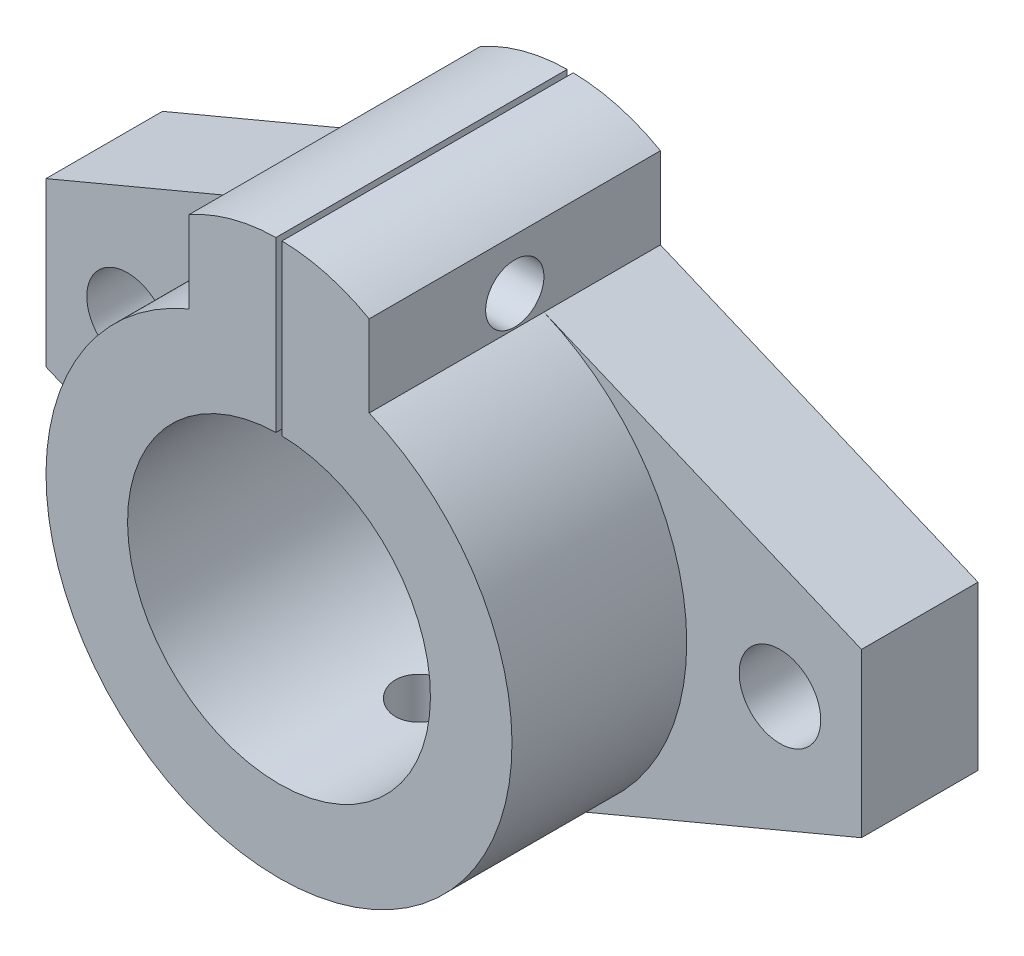
ISO-10303-21;
HEADER;
FILE_DESCRIPTION(('STEP AP214'),'2;1');
FILE_NAME('part.step','',(''),(''),'','','');
FILE_SCHEMA(('AUTOMOTIVE_DESIGN { 1 0 10303 214 1 1 1 1 }'));
ENDSEC;
DATA;
#1=APPLICATION_CONTEXT('core data for automotive mechanical design processes');
#2=APPLICATION_PROTOCOL_DEFINITION('international standard','automotive_design',2000,#1);
#3=PRODUCT_CONTEXT('',#1,'mechanical');
#4=PRODUCT('Part','Part','',(#3));
#5=PRODUCT_RELATED_PRODUCT_CATEGORY('part','',(#4));
#6=PRODUCT_DEFINITION_FORMATION('','',#4);
#7=PRODUCT_DEFINITION_CONTEXT('part definition',#1,'design');
#8=PRODUCT_DEFINITION('design','',#6,#7);
#9=PRODUCT_DEFINITION_SHAPE('','',#8);
#10=(LENGTH_UNIT() NAMED_UNIT(*) SI_UNIT(.MILLI.,.METRE.));
#11=(NAMED_UNIT(*) PLANE_ANGLE_UNIT() SI_UNIT($,.RADIAN.));
#12=(NAMED_UNIT(*) SI_UNIT($,.STERADIAN.) SOLID_ANGLE_UNIT());
#13=UNCERTAINTY_MEASURE_WITH_UNIT(LENGTH_MEASURE(1.E-05),#10,'distance_accuracy_value','');
#14=(GEOMETRIC_REPRESENTATION_CONTEXT(3) GLOBAL_UNCERTAINTY_ASSIGNED_CONTEXT((#13)) GLOBAL_UNIT_ASSIGNED_CONTEXT((#10,
#11,#12)) REPRESENTATION_CONTEXT('',''));
#15=CARTESIAN_POINT('',(0.,0.,0.));
#16=DIRECTION('',(0.,0.,1.));
#17=DIRECTION('',(1.,0.,0.));
#18=AXIS2_PLACEMENT_3D('',#15,#16,#17);
#19=CARTESIAN_POINT('',(0.,11.87489743787,10.));
#20=DIRECTION('',(0.,0.,-1.));
#21=DIRECTION('',(-1.,0.,0.));
#22=AXIS2_PLACEMENT_3D('',#19,#20,#21);
#23=CYLINDRICAL_SURFACE('',#22,15.6193467136848);
#24=DIRECTION('',(0.,0.,-1.));
#25=VECTOR('',#24,1.);
#26=CARTESIAN_POINT('',(-0.258597553957538,27.4921033040735,10.));
#27=LINE('',#26,#25);
#28=CARTESIAN_POINT('',(-0.258597553957538,27.4921033040735,0.));
#29=VERTEX_POINT('',#28);
#30=CARTESIAN_POINT('',(-0.258597553957538,27.4921033040735,25.));
#31=VERTEX_POINT('',#30);
#32=EDGE_CURVE('E64',#29,#31,#27,.F.);
#33=ORIENTED_EDGE('',*,*,#32,.F.);
#34=CARTESIAN_POINT('',(0.,11.87489743787,0.));
#35=DIRECTION('',(0.,0.,1.));
#36=DIRECTION('',(1.,0.,0.));
#37=AXIS2_PLACEMENT_3D('',#34,#35,#36);
#38=CIRCLE('',#37,15.6193467136848);
#39=CARTESIAN_POINT('',(-7.74027571439312,25.441478570472,0.));
#40=VERTEX_POINT('',#39);
#41=EDGE_CURVE('E304',#40,#29,#38,.F.);
#42=ORIENTED_EDGE('',*,*,#41,.F.);
#43=DIRECTION('',(0.,0.,-1.));
#44=VECTOR('',#43,1.);
#45=CARTESIAN_POINT('',(-7.74027571439312,25.441478570472,10.));
#46=LINE('',#45,#44);
#47=CARTESIAN_POINT('',(-7.74027571439312,25.441478570472,25.));
#48=VERTEX_POINT('',#47);
#49=EDGE_CURVE('E264',#48,#40,#46,.T.);
#50=ORIENTED_EDGE('',*,*,#49,.F.);
#51=CARTESIAN_POINT('',(0.,11.8748974378699,25.));
#52=DIRECTION('',(0.,0.,1.));
#53=DIRECTION('',(-1.,0.,0.));
#54=AXIS2_PLACEMENT_3D('',#51,#52,#53);
#55=CIRCLE('',#54,15.6193467136848);
#56=EDGE_CURVE('E169',#31,#48,#55,.T.);
#57=ORIENTED_EDGE('',*,*,#56,.F.);
#58=EDGE_LOOP('',(#33,#42,#50,#57));
#59=FACE_BOUND('',#58,.T.);
#60=ADVANCED_FACE('F36',(#59),#23,.T.);
#61=CARTESIAN_POINT('',(0.,0.,10.));
#62=DIRECTION('',(0.,0.,1.));
#63=DIRECTION('',(1.,0.,0.));
#64=AXIS2_PLACEMENT_3D('',#61,#62,#63);
#65=PLANE('',#64);
#66=CARTESIAN_POINT('',(0.,0.,10.));
#67=DIRECTION('',(0.,0.,1.));
#68=DIRECTION('',(1.,0.,0.));
#69=AXIS2_PLACEMENT_3D('',#66,#67,#68);
#70=CIRCLE('',#69,20.);
#71=CARTESIAN_POINT('',(-7.74027571439312,18.441478570472,10.));
#72=VERTEX_POINT('',#71);
#73=CARTESIAN_POINT('',(-7.74027571439311,-18.441478570472,10.));
#74=VERTEX_POINT('',#73);
#75=EDGE_CURVE('E182',#72,#74,#70,.T.);
#76=ORIENTED_EDGE('',*,*,#75,.F.);
#77=DIRECTION('',(0.922073928523597,0.387013785719656,0.));
#78=VECTOR('',#77,1.);
#79=CARTESIAN_POINT('',(-7.74027571439313,18.441478570472,10.));
#80=LINE('',#79,#78);
#81=CARTESIAN_POINT('',(-35.0000000000568,7.00000000013542,10.));
#82=VERTEX_POINT('',#81);
#83=EDGE_CURVE('E316',#82,#72,#80,.T.);
#84=ORIENTED_EDGE('',*,*,#83,.F.);
#85=DIRECTION('',(0.,1.,0.));
#86=VECTOR('',#85,1.);
#87=CARTESIAN_POINT('',(-35.0000000000568,0.,10.));
#88=LINE('',#87,#86);
#89=CARTESIAN_POINT('',(-35.0000000000568,-7.00000000013543,10.));
#90=VERTEX_POINT('',#89);
#91=EDGE_CURVE('E212',#90,#82,#88,.T.);
#92=ORIENTED_EDGE('',*,*,#91,.F.);
#93=DIRECTION('',(0.922073928523598,-0.387013785719656,0.));
#94=VECTOR('',#93,1.);
#95=CARTESIAN_POINT('',(-7.74027571439311,-18.441478570472,10.));
#96=LINE('',#95,#94);
#97=EDGE_CURVE('E208',#90,#74,#96,.T.);
#98=ORIENTED_EDGE('',*,*,#97,.T.);
#99=EDGE_LOOP('',(#76,#84,#92,#98));
#100=FACE_BOUND('',#99,.T.);
#101=CARTESIAN_POINT('',(-28.,0.,10.));
#102=DIRECTION('',(0.,0.,1.));
#103=DIRECTION('',(1.,0.,0.));
#104=AXIS2_PLACEMENT_3D('',#101,#102,#103);
#105=CIRCLE('',#104,3.5);
#106=CARTESIAN_POINT('',(-24.5,0.,10.));
#107=VERTEX_POINT('',#106);
#108=EDGE_CURVE('E276',#107,#107,#105,.T.);
#109=ORIENTED_EDGE('',*,*,#108,.F.);
#110=EDGE_LOOP('',(#109));
#111=FACE_BOUND('',#110,.T.);
#112=ADVANCED_FACE('F350',(#100,#111),#65,.T.);
#113=CARTESIAN_POINT('',(7.74027571439313,18.441478570472,10.));
#114=DIRECTION('',(-0.387013785719656,-0.922073928523597,0.));
#115=DIRECTION('',(0.922073928523597,-0.387013785719656,0.));
#116=AXIS2_PLACEMENT_3D('',#113,#114,#115);
#117=PLANE('',#116);
#118=DIRECTION('',(-0.922073928523597,0.387013785719656,0.));
#119=VECTOR('',#118,1.);
#120=CARTESIAN_POINT('',(7.74027571439313,18.441478570472,0.));
#121=LINE('',#120,#119);
#122=CARTESIAN_POINT('',(35.0000000000568,7.00000000013542,0.));
#123=VERTEX_POINT('',#122);
#124=CARTESIAN_POINT('',(7.74027571439312,18.441478570472,0.));
#125=VERTEX_POINT('',#124);
#126=EDGE_CURVE('E181',#123,#125,#121,.T.);
#127=ORIENTED_EDGE('',*,*,#126,.T.);
#128=DIRECTION('',(0.,0.,-1.));
#129=VECTOR('',#128,1.);
#130=CARTESIAN_POINT('',(7.74027571439312,18.441478570472,10.));
#131=LINE('',#130,#129);
#132=CARTESIAN_POINT('',(7.74027571439312,18.441478570472,10.));
#133=VERTEX_POINT('',#132);
#134=EDGE_CURVE('E193',#133,#125,#131,.T.);
#135=ORIENTED_EDGE('',*,*,#134,.F.);
#136=DIRECTION('',(-0.922073928523597,0.387013785719656,0.));
#137=VECTOR('',#136,1.);
#138=CARTESIAN_POINT('',(7.74027571439313,18.441478570472,10.));
#139=LINE('',#138,#137);
#140=CARTESIAN_POINT('',(35.0000000000568,7.00000000013542,10.));
#141=VERTEX_POINT('',#140);
#142=EDGE_CURVE('E188',#141,#133,#139,.T.);
#143=ORIENTED_EDGE('',*,*,#142,.F.);
#144=DIRECTION('',(0.,0.,-1.));
#145=VECTOR('',#144,1.);
#146=CARTESIAN_POINT('',(35.0000000000568,7.00000000013542,10.));
#147=LINE('',#146,#145);
#148=EDGE_CURVE('E273',#141,#123,#147,.T.);
#149=ORIENTED_EDGE('',*,*,#148,.T.);
#150=EDGE_LOOP('',(#127,#135,#143,#149));
#151=FACE_BOUND('',#150,.T.);
#152=ADVANCED_FACE('F38',(#151),#117,.F.);
#153=CARTESIAN_POINT('',(7.74027571439312,0.,10.));
#154=DIRECTION('',(-1.,0.,0.));
#155=DIRECTION('',(0.,0.,1.));
#156=AXIS2_PLACEMENT_3D('',#153,#154,#155);
#157=PLANE('',#156);
#158=CARTESIAN_POINT('',(7.74027571439312,21.0864235760214,12.5));
#159=DIRECTION('',(1.,0.,0.));
#160=DIRECTION('',(0.,0.,-1.));
#161=AXIS2_PLACEMENT_3D('',#158,#159,#160);
#162=CIRCLE('',#161,2.5);
#163=CARTESIAN_POINT('',(7.74027571439312,21.0864235760214,10.));
#164=VERTEX_POINT('',#163);
#165=EDGE_CURVE('E222',#164,#164,#162,.T.);
#166=ORIENTED_EDGE('',*,*,#165,.F.);
#167=EDGE_LOOP('',(#166));
#168=FACE_BOUND('',#167,.T.);
#169=DIRECTION('',(0.,1.,0.));
#170=VECTOR('',#169,1.);
#171=CARTESIAN_POINT('',(7.74027571439312,0.,0.));
#172=LINE('',#171,#170);
#173=CARTESIAN_POINT('',(7.74027571439312,25.441478570472,0.));
#174=VERTEX_POINT('',#173);
#175=EDGE_CURVE('E263',#125,#174,#172,.T.);
#176=ORIENTED_EDGE('',*,*,#175,.T.);
#177=DIRECTION('',(0.,0.,-1.));
#178=VECTOR('',#177,1.);
#179=CARTESIAN_POINT('',(7.74027571439312,25.441478570472,10.));
#180=LINE('',#179,#178);
#181=CARTESIAN_POINT('',(7.74027571439312,25.441478570472,25.));
#182=VERTEX_POINT('',#181);
#183=EDGE_CURVE('E262',#182,#174,#180,.T.);
#184=ORIENTED_EDGE('',*,*,#183,.F.);
#185=DIRECTION('',(0.,1.,0.));
#186=VECTOR('',#185,1.);
#187=CARTESIAN_POINT('',(7.74027571439312,18.441478570472,25.));
#188=LINE('',#187,#186);
#189=CARTESIAN_POINT('',(7.74027571439312,18.441478570472,25.));
#190=VERTEX_POINT('',#189);
#191=EDGE_CURVE('E167',#190,#182,#188,.T.);
#192=ORIENTED_EDGE('',*,*,#191,.F.);
#193=DIRECTION('',(0.,0.,-1.));
#194=VECTOR('',#193,1.);
#195=CARTESIAN_POINT('',(7.74027571439312,18.441478570472,25.));
#196=LINE('',#195,#194);
#197=EDGE_CURVE('E178',#190,#133,#196,.T.);
#198=ORIENTED_EDGE('',*,*,#197,.T.);
#199=ORIENTED_EDGE('',*,*,#134,.T.);
#200=EDGE_LOOP('',(#176,#184,#192,#198,#199));
#201=FACE_BOUND('',#200,.T.);
#202=ADVANCED_FACE('F260',(#168,#201),#157,.F.);
#203=DIRECTION('',(0.,0.,-1.));
#204=VECTOR('',#203,1.);
#205=CARTESIAN_POINT('',(0.258597553957538,27.4921033040735,10.));
#206=LINE('',#205,#204);
#207=CARTESIAN_POINT('',(0.258597553957538,27.4921033040735,25.));
#208=VERTEX_POINT('',#207);
#209=CARTESIAN_POINT('',(0.258597553957538,27.4921033040735,0.));
#210=VERTEX_POINT('',#209);
#211=EDGE_CURVE('E147',#208,#210,#206,.T.);
#212=ORIENTED_EDGE('',*,*,#211,.F.);
#213=EDGE_CURVE('E160',#182,#208,#55,.T.);
#214=ORIENTED_EDGE('',*,*,#213,.F.);
#215=ORIENTED_EDGE('',*,*,#183,.T.);
#216=EDGE_CURVE('E161',#210,#174,#38,.F.);
#217=ORIENTED_EDGE('',*,*,#216,.F.);
#218=EDGE_LOOP('',(#212,#214,#215,#217));
#219=FACE_BOUND('',#218,.T.);
#220=ADVANCED_FACE('F158',(#219),#23,.T.);
#221=CARTESIAN_POINT('',(-7.74027571439312,0.,10.));
#222=DIRECTION('',(-1.,0.,0.));
#223=DIRECTION('',(0.,0.,1.));
#224=AXIS2_PLACEMENT_3D('',#221,#222,#223);
#225=PLANE('',#224);
#226=CARTESIAN_POINT('',(-7.74027571439312,21.0864235760214,12.5));
#227=DIRECTION('',(-1.,0.,0.));
#228=DIRECTION('',(0.,0.,1.));
#229=AXIS2_PLACEMENT_3D('',#226,#227,#228);
#230=CIRCLE('',#229,2.5);
#231=CARTESIAN_POINT('',(-7.74027571439312,21.0864235760214,15.));
#232=VERTEX_POINT('',#231);
#233=EDGE_CURVE('E226',#232,#232,#230,.T.);
#234=ORIENTED_EDGE('',*,*,#233,.F.);
#235=EDGE_LOOP('',(#234));
#236=FACE_BOUND('',#235,.T.);
#237=DIRECTION('',(0.,1.,0.));
#238=VECTOR('',#237,1.);
#239=CARTESIAN_POINT('',(-7.74027571439312,0.,0.));
#240=LINE('',#239,#238);
#241=CARTESIAN_POINT('',(-7.74027571439312,18.441478570472,0.));
#242=VERTEX_POINT('',#241);
#243=EDGE_CURVE('E301',#242,#40,#240,.T.);
#244=ORIENTED_EDGE('',*,*,#243,.F.);
#245=DIRECTION('',(0.,0.,-1.));
#246=VECTOR('',#245,1.);
#247=CARTESIAN_POINT('',(-7.74027571439312,18.441478570472,10.));
#248=LINE('',#247,#246);
#249=EDGE_CURVE('E265',#72,#242,#248,.T.);
#250=ORIENTED_EDGE('',*,*,#249,.F.);
#251=DIRECTION('',(0.,0.,-1.));
#252=VECTOR('',#251,1.);
#253=CARTESIAN_POINT('',(-7.74027571439312,18.441478570472,25.));
#254=LINE('',#253,#252);
#255=CARTESIAN_POINT('',(-7.74027571439312,18.441478570472,25.));
#256=VERTEX_POINT('',#255);
#257=EDGE_CURVE('E171',#256,#72,#254,.T.);
#258=ORIENTED_EDGE('',*,*,#257,.F.);
#259=DIRECTION('',(0.,-1.,0.));
#260=VECTOR('',#259,1.);
#261=CARTESIAN_POINT('',(-7.74027571439312,18.441478570472,25.));
#262=LINE('',#261,#260);
#263=EDGE_CURVE('E168',#48,#256,#262,.T.);
#264=ORIENTED_EDGE('',*,*,#263,.F.);
#265=ORIENTED_EDGE('',*,*,#49,.T.);
#266=EDGE_LOOP('',(#244,#250,#258,#264,#265));
#267=FACE_BOUND('',#266,.T.);
#268=ADVANCED_FACE('F345',(#236,#267),#225,.T.);
#269=CARTESIAN_POINT('',(-7.74027571439313,18.441478570472,10.));
#270=DIRECTION('',(-0.387013785719656,0.922073928523597,0.));
#271=DIRECTION('',(-0.922073928523597,-0.387013785719656,0.));
#272=AXIS2_PLACEMENT_3D('',#269,#270,#271);
#273=PLANE('',#272);
#274=DIRECTION('',(0.922073928523597,0.387013785719656,0.));
#275=VECTOR('',#274,1.);
#276=CARTESIAN_POINT('',(-7.74027571439313,18.441478570472,0.));
#277=LINE('',#276,#275);
#278=CARTESIAN_POINT('',(-35.0000000000568,7.00000000013542,0.));
#279=VERTEX_POINT('',#278);
#280=EDGE_CURVE('E298',#279,#242,#277,.T.);
#281=ORIENTED_EDGE('',*,*,#280,.F.);
#282=DIRECTION('',(0.,0.,-1.));
#283=VECTOR('',#282,1.);
#284=CARTESIAN_POINT('',(-35.0000000000568,7.00000000013542,10.));
#285=LINE('',#284,#283);
#286=EDGE_CURVE('E269',#82,#279,#285,.T.);
#287=ORIENTED_EDGE('',*,*,#286,.F.);
#288=ORIENTED_EDGE('',*,*,#83,.T.);
#289=ORIENTED_EDGE('',*,*,#249,.T.);
#290=EDGE_LOOP('',(#281,#287,#288,#289));
#291=FACE_BOUND('',#290,.T.);
#292=ADVANCED_FACE('F361',(#291),#273,.T.);
#293=CARTESIAN_POINT('',(-35.0000000000568,0.,10.));
#294=DIRECTION('',(-1.,0.,0.));
#295=DIRECTION('',(0.,0.,1.));
#296=AXIS2_PLACEMENT_3D('',#293,#294,#295);
#297=PLANE('',#296);
#298=DIRECTION('',(0.,1.,0.));
#299=VECTOR('',#298,1.);
#300=CARTESIAN_POINT('',(-35.0000000000568,0.,0.));
#301=LINE('',#300,#299);
#302=CARTESIAN_POINT('',(-35.0000000000568,-7.00000000013543,0.));
#303=VERTEX_POINT('',#302);
#304=EDGE_CURVE('E295',#303,#279,#301,.T.);
#305=ORIENTED_EDGE('',*,*,#304,.F.);
#306=DIRECTION('',(0.,0.,-1.));
#307=VECTOR('',#306,1.);
#308=CARTESIAN_POINT('',(-35.0000000000568,-7.00000000013543,10.));
#309=LINE('',#308,#307);
#310=EDGE_CURVE('E217',#90,#303,#309,.T.);
#311=ORIENTED_EDGE('',*,*,#310,.F.);
#312=ORIENTED_EDGE('',*,*,#91,.T.);
#313=ORIENTED_EDGE('',*,*,#286,.T.);
#314=EDGE_LOOP('',(#305,#311,#312,#313));
#315=FACE_BOUND('',#314,.T.);
#316=ADVANCED_FACE('F359',(#315),#297,.T.);
#317=CARTESIAN_POINT('',(-7.74027571439311,-18.441478570472,10.));
#318=DIRECTION('',(0.387013785719656,0.922073928523598,0.));
#319=DIRECTION('',(-0.922073928523598,0.387013785719656,0.));
#320=AXIS2_PLACEMENT_3D('',#317,#318,#319);
#321=PLANE('',#320);
#322=DIRECTION('',(0.922073928523598,-0.387013785719656,0.));
#323=VECTOR('',#322,1.);
#324=CARTESIAN_POINT('',(-7.74027571439311,-18.441478570472,0.));
#325=LINE('',#324,#323);
#326=CARTESIAN_POINT('',(-7.74027571439311,-18.441478570472,0.));
#327=VERTEX_POINT('',#326);
#328=EDGE_CURVE('E293',#303,#327,#325,.T.);
#329=ORIENTED_EDGE('',*,*,#328,.T.);
#330=DIRECTION('',(0.,0.,-1.));
#331=VECTOR('',#330,1.);
#332=CARTESIAN_POINT('',(-7.74027571439311,-18.441478570472,10.));
#333=LINE('',#332,#331);
#334=EDGE_CURVE('E200',#74,#327,#333,.T.);
#335=ORIENTED_EDGE('',*,*,#334,.F.);
#336=ORIENTED_EDGE('',*,*,#97,.F.);
#337=ORIENTED_EDGE('',*,*,#310,.T.);
#338=EDGE_LOOP('',(#329,#335,#336,#337));
#339=FACE_BOUND('',#338,.T.);
#340=ADVANCED_FACE('F355',(#339),#321,.F.);
#341=CARTESIAN_POINT('',(0.,0.,10.));
#342=DIRECTION('',(0.,0.,-1.));
#343=DIRECTION('',(-1.,0.,0.));
#344=AXIS2_PLACEMENT_3D('',#341,#342,#343);
#345=CYLINDRICAL_SURFACE('',#344,20.);
#346=CARTESIAN_POINT('',(0.,-20.,15.));
#347=CARTESIAN_POINT('',(0.139841095555763,-19.9999980489643,14.9999940590643));
#348=CARTESIAN_POINT('',(0.279769574302749,-19.998517845549,14.9882271208307));
#349=CARTESIAN_POINT('',(0.555732802089754,-19.9927554011136,14.9414722454292));
#350=CARTESIAN_POINT('',(0.691763330623746,-19.9884702344143,14.9064600620766));
#351=CARTESIAN_POINT('',(0.955895574813055,-19.9775806104441,14.8142623560859));
#352=CARTESIAN_POINT('',(1.08400256014614,-19.9709777145554,14.7570917581901));
#353=CARTESIAN_POINT('',(1.32877947489304,-19.956187008781,14.6222327160302));
#354=CARTESIAN_POINT('',(1.44545136155637,-19.9479994708412,14.5445477914693));
#355=CARTESIAN_POINT('',(1.66471281693132,-19.9309032130633,14.3704080501604));
#356=CARTESIAN_POINT('',(1.76723036493713,-19.9219911469242,14.2738628706538));
#357=CARTESIAN_POINT('',(1.95465279355749,-19.9044772600975,14.0649371764634));
#358=CARTESIAN_POINT('',(2.03955677639225,-19.8958754552427,13.9525558550868));
#359=CARTESIAN_POINT('',(2.18961016128394,-19.8799230561959,13.7146800224343));
#360=CARTESIAN_POINT('',(2.25469209594107,-19.8725767717791,13.5891426384321));
#361=CARTESIAN_POINT('',(2.36282307657512,-19.8600112845768,13.3288129480526));
#362=CARTESIAN_POINT('',(2.40587295806522,-19.8547920011314,13.194020992853));
#363=CARTESIAN_POINT('',(2.46849898002477,-19.8471033960361,12.9197558044132));
#364=CARTESIAN_POINT('',(2.4881967147317,-19.8446198343675,12.7803107422958));
#365=CARTESIAN_POINT('',(2.50393554955723,-19.8426402814279,12.5000737365282));
#366=CARTESIAN_POINT('',(2.49997760100242,-19.8431441700151,12.3592818472687));
#367=CARTESIAN_POINT('',(2.46861723644791,-19.8470695536975,12.0811951727512));
#368=CARTESIAN_POINT('',(2.4413487629847,-19.8504743796033,11.9438850137997));
#369=CARTESIAN_POINT('',(2.36435038318205,-19.8597919975763,11.675804978781));
#370=CARTESIAN_POINT('',(2.3146200217519,-19.8657048404572,11.545035235286));
#371=CARTESIAN_POINT('',(2.19396555991165,-19.8793911586465,11.2933320009783));
#372=CARTESIAN_POINT('',(2.12298325370764,-19.8871697321144,11.172426699751));
#373=CARTESIAN_POINT('',(1.96188146945692,-19.903707114306,10.9441933055868));
#374=CARTESIAN_POINT('',(1.87176111608078,-19.9124659678566,10.8368658340263));
#375=CARTESIAN_POINT('',(1.67419911075378,-19.9300510989043,10.6380572892773));
#376=CARTESIAN_POINT('',(1.56664200784001,-19.9388774238689,10.546690908234));
#377=CARTESIAN_POINT('',(1.33765716911392,-19.9555463255585,10.3832911199695));
#378=CARTESIAN_POINT('',(1.21622940131825,-19.9633889000151,10.311257757328));
#379=CARTESIAN_POINT('',(0.962861671363483,-19.9772115221858,10.1885686795361));
#380=CARTESIAN_POINT('',(0.830918195337718,-19.9831909440154,10.1379201461188));
#381=CARTESIAN_POINT('',(0.560307940431057,-19.9926078578006,10.0595295064767));
#382=CARTESIAN_POINT('',(0.421641476630669,-19.9960454687587,10.031786327863));
#383=CARTESIAN_POINT('',(0.142513163913499,-19.9999759641076,10.0001425757394));
#384=CARTESIAN_POINT('',(0.0020694901986087,-20.0004883614264,9.99608400763593));
#385=CARTESIAN_POINT('',(-0.277496036497495,-19.9985633800543,10.011507734056));
#386=CARTESIAN_POINT('',(-0.416617917564705,-19.9961260641821,10.0309895272516));
#387=CARTESIAN_POINT('',(-0.68912450772152,-19.9885876875669,10.0928097087744));
#388=CARTESIAN_POINT('',(-0.822526570424704,-19.9834954081387,10.1350727634026));
#389=CARTESIAN_POINT('',(-1.08034965485841,-19.971217231002,10.2411774519129));
#390=CARTESIAN_POINT('',(-1.20477037146531,-19.9640312622062,10.3050198184914));
#391=CARTESIAN_POINT('',(-1.44180452068743,-19.9483182291011,10.4528531375075));
#392=CARTESIAN_POINT('',(-1.55435375994382,-19.9397844404251,10.5369462898056));
#393=CARTESIAN_POINT('',(-1.76379698962632,-19.9223514232566,10.7227494975342));
#394=CARTESIAN_POINT('',(-1.86069035833686,-19.913452180269,10.824460252251));
#395=CARTESIAN_POINT('',(-2.03663195881801,-19.8962310546258,11.0433074167571));
#396=CARTESIAN_POINT('',(-2.11557546056793,-19.8879127472133,11.1605283463104));
#397=CARTESIAN_POINT('',(-2.2526528894435,-19.8728541103715,11.4066582448547));
#398=CARTESIAN_POINT('',(-2.31078723372837,-19.8661137493103,11.5355669794765));
#399=CARTESIAN_POINT('',(-2.40442657886654,-19.85499850393,11.8010753191476));
#400=CARTESIAN_POINT('',(-2.43999062745711,-19.8506174518479,11.937653830048));
#401=CARTESIAN_POINT('',(-2.48766999386784,-19.8446991590746,12.2149024837807));
#402=CARTESIAN_POINT('',(-2.49978640253576,-19.8431617860878,12.355572435959));
#403=CARTESIAN_POINT('',(-2.50020653608484,-19.8431087698246,12.6359689292047));
#404=CARTESIAN_POINT('',(-2.48867479769927,-19.8445722475195,12.7756952483319));
#405=CARTESIAN_POINT('',(-2.44247440484932,-19.850311145372,13.0512071293451));
#406=CARTESIAN_POINT('',(-2.40780574790577,-19.8545865658308,13.1869926908088));
#407=CARTESIAN_POINT('',(-2.31636707368966,-19.8654611577455,13.4507469567664));
#408=CARTESIAN_POINT('',(-2.25960498097093,-19.8720594959278,13.5787184450218));
#409=CARTESIAN_POINT('',(-2.12560690215031,-19.8868378324482,13.8233466540483));
#410=CARTESIAN_POINT('',(-2.04837065950959,-19.8950178506041,13.9400032330198));
#411=CARTESIAN_POINT('',(-1.87500633126584,-19.9121060475223,14.1595312253405));
#412=CARTESIAN_POINT('',(-1.77875562577496,-19.9210187208403,14.262305460955));
#413=CARTESIAN_POINT('',(-1.57035022696838,-19.938528315929,14.450306825168));
#414=CARTESIAN_POINT('',(-1.45819178914157,-19.9471251627559,14.5355298107743));
#415=CARTESIAN_POINT('',(-1.22066562085421,-19.9630705658675,14.6862853571053));
#416=CARTESIAN_POINT('',(-1.09524927959617,-19.970414250783,14.7517418058993));
#417=CARTESIAN_POINT('',(-0.835182902301281,-19.9829764907673,14.8605712429163));
#418=CARTESIAN_POINT('',(-0.700543080870236,-19.9881973536958,14.9039682263535));
#419=CARTESIAN_POINT('',(-0.471005771967924,-19.9946672032775,14.9570593381713));
#420=CARTESIAN_POINT('',(-0.37755566351692,-19.9966572589545,14.9731389419821));
#421=CARTESIAN_POINT('',(-0.189417063212434,-19.9993243132919,14.9946112456932));
#422=CARTESIAN_POINT('',(-0.0947285804960259,-20.0000013216347,15.0000040243993));
#423=CARTESIAN_POINT('',(0.,-20.,15.));
#424=B_SPLINE_CURVE_WITH_KNOTS('',3,(#346,#347,#348,#349,#350,#351,#352,#353,#354,#355,#356,
#357,#358,#359,#360,#361,#362,#363,#364,#365,#366,#367,#368,#369,#370,#371,#372,#373,#374,#375,
#376,#377,#378,#379,#380,#381,#382,#383,#384,#385,#386,#387,#388,#389,#390,#391,#392,#393,#394,
#395,#396,#397,#398,#399,#400,#401,#402,#403,#404,#405,#406,#407,#408,#409,#410,#411,#412,#413,
#414,#415,#416,#417,#418,#419,#420,#421,#422,#423),.UNSPECIFIED.,.T.,.F.,(4,2,2,2,2,2,2,2,2,2,2,
2,2,2,2,2,2,2,2,2,2,2,2,2,2,2,2,2,2,2,2,2,2,2,2,2,2,2,4),(0.,0.419177272776247,
0.838792460943427,1.25812550818177,1.67738665591073,2.09870813201843,2.52005107800011,
2.9428125031887,3.36555789496807,3.78609225286321,4.20660969884664,4.62472696441692,
5.04285270166241,5.46213426285534,5.88143500513639,6.30363478136417,6.72583553113114,
7.14817795731605,7.57050060903781,7.99000279391921,8.40949604501929,8.82761053893396,
9.24573923078948,9.66602402928422,10.0863255137509,10.5090197150757,10.9317054422154,
11.3532807428093,11.7748364301062,12.1934690120222,12.6121016387955,13.0305842470649,
13.4490720991226,13.8703523769183,14.2917319847001,14.7147140303685,15.1372349868403,
15.4211884318763,15.7051397830044),.UNSPECIFIED.);
#425=CARTESIAN_POINT('',(0.,-20.,15.));
#426=VERTEX_POINT('',#425);
#427=EDGE_CURVE('E229',#426,#426,#424,.T.);
#428=ORIENTED_EDGE('',*,*,#427,.T.);
#429=EDGE_LOOP('',(#428));
#430=FACE_BOUND('',#429,.T.);
#431=CARTESIAN_POINT('',(0.,0.,0.));
#432=DIRECTION('',(0.,0.,1.));
#433=DIRECTION('',(1.,0.,0.));
#434=AXIS2_PLACEMENT_3D('',#431,#432,#433);
#435=CIRCLE('',#434,20.);
#436=CARTESIAN_POINT('',(7.74027571439311,-18.441478570472,0.));
#437=VERTEX_POINT('',#436);
#438=EDGE_CURVE('E291',#327,#437,#435,.T.);
#439=ORIENTED_EDGE('',*,*,#438,.T.);
#440=DIRECTION('',(0.,0.,-1.));
#441=VECTOR('',#440,1.);
#442=CARTESIAN_POINT('',(7.74027571439311,-18.441478570472,10.));
#443=LINE('',#442,#441);
#444=CARTESIAN_POINT('',(7.74027571439311,-18.441478570472,10.));
#445=VERTEX_POINT('',#444);
#446=EDGE_CURVE('E198',#445,#437,#443,.T.);
#447=ORIENTED_EDGE('',*,*,#446,.F.);
#448=EDGE_CURVE('E153',#445,#133,#70,.T.);
#449=ORIENTED_EDGE('',*,*,#448,.T.);
#450=ORIENTED_EDGE('',*,*,#197,.F.);
#451=CARTESIAN_POINT('',(0.,0.,25.));
#452=DIRECTION('',(0.,0.,1.));
#453=DIRECTION('',(1.,0.,0.));
#454=AXIS2_PLACEMENT_3D('',#451,#452,#453);
#455=CIRCLE('',#454,20.);
#456=EDGE_CURVE('E186',#256,#190,#455,.T.);
#457=ORIENTED_EDGE('',*,*,#456,.F.);
#458=ORIENTED_EDGE('',*,*,#257,.T.);
#459=ORIENTED_EDGE('',*,*,#75,.T.);
#460=ORIENTED_EDGE('',*,*,#334,.T.);
#461=EDGE_LOOP('',(#439,#447,#449,#450,#457,#458,#459,#460));
#462=FACE_BOUND('',#461,.T.);
#463=ADVANCED_FACE('F255',(#430,#462),#345,.T.);
#464=CARTESIAN_POINT('',(7.74027571439311,-18.441478570472,10.));
#465=DIRECTION('',(0.387013785719656,-0.922073928523598,0.));
#466=DIRECTION('',(0.922073928523598,0.387013785719656,0.));
#467=AXIS2_PLACEMENT_3D('',#464,#465,#466);
#468=PLANE('',#467);
#469=DIRECTION('',(-0.922073928523598,-0.387013785719656,0.));
#470=VECTOR('',#469,1.);
#471=CARTESIAN_POINT('',(7.74027571439311,-18.441478570472,0.));
#472=LINE('',#471,#470);
#473=CARTESIAN_POINT('',(35.0000000000568,-7.00000000013543,0.));
#474=VERTEX_POINT('',#473);
#475=EDGE_CURVE('E288',#474,#437,#472,.T.);
#476=ORIENTED_EDGE('',*,*,#475,.F.);
#477=DIRECTION('',(0.,0.,-1.));
#478=VECTOR('',#477,1.);
#479=CARTESIAN_POINT('',(35.0000000000568,-7.00000000013543,10.));
#480=LINE('',#479,#478);
#481=CARTESIAN_POINT('',(35.0000000000568,-7.00000000013543,10.));
#482=VERTEX_POINT('',#481);
#483=EDGE_CURVE('E201',#482,#474,#480,.T.);
#484=ORIENTED_EDGE('',*,*,#483,.F.);
#485=DIRECTION('',(-0.922073928523598,-0.387013785719656,0.));
#486=VECTOR('',#485,1.);
#487=CARTESIAN_POINT('',(7.74027571439311,-18.441478570472,10.));
#488=LINE('',#487,#486);
#489=EDGE_CURVE('E204',#482,#445,#488,.T.);
#490=ORIENTED_EDGE('',*,*,#489,.T.);
#491=ORIENTED_EDGE('',*,*,#446,.T.);
#492=EDGE_LOOP('',(#476,#484,#490,#491));
#493=FACE_BOUND('',#492,.T.);
#494=ADVANCED_FACE('F433',(#493),#468,.T.);
#495=CARTESIAN_POINT('',(0.,0.,10.));
#496=DIRECTION('',(0.,0.,-1.));
#497=DIRECTION('',(-1.,0.,0.));
#498=AXIS2_PLACEMENT_3D('',#495,#496,#497);
#499=CYLINDRICAL_SURFACE('',#498,13.);
#500=CARTESIAN_POINT('',(0.,-13.,15.));
#501=CARTESIAN_POINT('',(0.139052660180755,-12.9999974610984,14.9999947587803));
#502=CARTESIAN_POINT('',(0.278172773072156,-12.9977459806996,14.988359412702));
#503=CARTESIAN_POINT('',(0.552488133091362,-12.9889814495606,14.9421580551378));
#504=CARTESIAN_POINT('',(0.6876800448946,-12.9824648818705,14.907573119314));
#505=CARTESIAN_POINT('',(0.950132537462373,-12.9658986493339,14.8165744195119));
#506=CARTESIAN_POINT('',(1.07740031971374,-12.9558522492613,14.7601808217264));
#507=CARTESIAN_POINT('',(1.32065723842359,-12.9333215487838,14.6272238720737));
#508=CARTESIAN_POINT('',(1.43664719548845,-12.9208374259537,14.5506619892138));
#509=CARTESIAN_POINT('',(1.65552432974222,-12.8946323002435,14.3785208342922));
#510=CARTESIAN_POINT('',(1.75824929536754,-12.8808989548617,14.2827371685489));
#511=CARTESIAN_POINT('',(1.94627668615617,-12.8538341361733,14.0753109628053));
#512=CARTESIAN_POINT('',(2.03157781945352,-12.8405026927278,13.9636672479234));
#513=CARTESIAN_POINT('',(2.18301679620622,-12.8156309401952,13.7265360046422));
#514=CARTESIAN_POINT('',(2.24898851450226,-12.8041065326509,13.6009405688997));
#515=CARTESIAN_POINT('',(2.35883220315187,-12.7843281256073,13.3401900899734));
#516=CARTESIAN_POINT('',(2.40270618335278,-12.7760738286974,13.2050359174576));
#517=CARTESIAN_POINT('',(2.46658610457138,-12.7638947012764,12.9307438082808));
#518=CARTESIAN_POINT('',(2.48687558791542,-12.7599184822057,12.7916742333029));
#519=CARTESIAN_POINT('',(2.50389090184761,-12.7565908775945,12.51205236308));
#520=CARTESIAN_POINT('',(2.50061895687192,-12.7572390554642,12.3715002090564));
#521=CARTESIAN_POINT('',(2.47083395608554,-12.763040258418,12.0949647768379));
#522=CARTESIAN_POINT('',(2.44464430650054,-12.7681305946622,11.9589451552352));
#523=CARTESIAN_POINT('',(2.37027708135778,-12.7821440039021,11.6932670168844));
#524=CARTESIAN_POINT('',(2.32209852760331,-12.7910672474073,11.5636087834127));
#525=CARTESIAN_POINT('',(2.20480765459312,-12.8118060352358,11.3133930561805));
#526=CARTESIAN_POINT('',(2.13556565597228,-12.8236394070727,11.192897889492));
#527=CARTESIAN_POINT('',(1.97820505089348,-12.848853471063,10.9651150288614));
#528=CARTESIAN_POINT('',(1.89008443268647,-12.8622343280499,10.8578287444083));
#529=CARTESIAN_POINT('',(1.69572891132668,-12.889308238097,10.6576414657792));
#530=CARTESIAN_POINT('',(1.58921761155993,-12.9030027865394,10.5650088099632));
#531=CARTESIAN_POINT('',(1.36202665615399,-12.9289572102898,10.3988844926995));
#532=CARTESIAN_POINT('',(1.24134684412448,-12.9412170697587,10.3253930425589));
#533=CARTESIAN_POINT('',(0.988957762488795,-12.9629474861032,10.1995939529603));
#534=CARTESIAN_POINT('',(0.857233713043069,-12.9724142260635,10.1473152653828));
#535=CARTESIAN_POINT('',(0.586650569197116,-12.9874624721642,10.0657025766531));
#536=CARTESIAN_POINT('',(0.447792274642339,-12.993044412827,10.0363660093348));
#537=CARTESIAN_POINT('',(0.169189915144617,-12.9996341283048,10.0018462338464));
#538=CARTESIAN_POINT('',(0.0294929779953188,-13.0007114935454,9.99629552815896));
#539=CARTESIAN_POINT('',(-0.248832636592823,-12.9983632998844,10.0085177771966));
#540=CARTESIAN_POINT('',(-0.38746136898675,-12.994937974206,10.0262895239023));
#541=CARTESIAN_POINT('',(-0.658542242580221,-12.9840126871957,10.084346743995));
#542=CARTESIAN_POINT('',(-0.791035903724993,-12.976546573136,10.1244452784258));
#543=CARTESIAN_POINT('',(-1.04741955600189,-12.9583735448858,10.2258147801244));
#544=CARTESIAN_POINT('',(-1.1713089389197,-12.9476664018813,10.2870872422973));
#545=CARTESIAN_POINT('',(-1.40852868267246,-12.924025465347,10.4298717431747));
#546=CARTESIAN_POINT('',(-1.52172218526331,-12.9110676225358,10.5116070915368));
#547=CARTESIAN_POINT('',(-1.73291860543103,-12.8844225517876,10.6926962234974));
#548=CARTESIAN_POINT('',(-1.83092002380893,-12.8707352520445,10.792051743834));
#549=CARTESIAN_POINT('',(-2.01035510164863,-12.8439416383922,11.007228161396));
#550=CARTESIAN_POINT('',(-2.09153739238512,-12.8308461515727,11.123260250283));
#551=CARTESIAN_POINT('',(-2.23325948833317,-12.8069410375943,11.3675303242733));
#552=CARTESIAN_POINT('',(-2.29380008432373,-12.796131322874,11.4957678415486));
#553=CARTESIAN_POINT('',(-2.39216884187718,-12.7781075731774,11.7601863589462));
#554=CARTESIAN_POINT('',(-2.43010977595277,-12.770875715852,11.8963241334675));
#555=CARTESIAN_POINT('',(-2.48254790543446,-12.7607868732141,12.1731950732065));
#556=CARTESIAN_POINT('',(-2.49704789991888,-12.7579293655635,12.3139276877074));
#557=CARTESIAN_POINT('',(-2.50209511687347,-12.7569402050647,12.5934733559216));
#558=CARTESIAN_POINT('',(-2.49303910212207,-12.7587302704385,12.7322791229674));
#559=CARTESIAN_POINT('',(-2.45210266538041,-12.7666604796616,13.0063499445064));
#560=CARTESIAN_POINT('',(-2.42022239691185,-12.7728005942514,13.1416150228088));
#561=CARTESIAN_POINT('',(-2.33471347717499,-12.7887053259627,13.404536619842));
#562=CARTESIAN_POINT('',(-2.28112994200388,-12.7984624206699,13.5322082959176));
#563=CARTESIAN_POINT('',(-2.15377970785527,-12.8205066533974,13.7768123618909));
#564=CARTESIAN_POINT('',(-2.08001148134918,-12.8327939828824,13.8937439381089));
#565=CARTESIAN_POINT('',(-1.91301563814429,-12.8587559030273,14.1155315746846));
#566=CARTESIAN_POINT('',(-1.81950009853845,-12.8724492796511,14.2201686814821));
#567=CARTESIAN_POINT('',(-1.61626238485009,-12.8995420316146,14.4123973754943));
#568=CARTESIAN_POINT('',(-1.50653649326075,-12.9129413387038,14.4999850420681));
#569=CARTESIAN_POINT('',(-1.27273625734663,-12.9380865705891,14.6564130168556));
#570=CARTESIAN_POINT('',(-1.14853493486942,-12.9498154901243,14.7250663700691));
#571=CARTESIAN_POINT('',(-0.890172259350413,-12.9701319076699,14.8404207923641));
#572=CARTESIAN_POINT('',(-0.756020253294855,-12.9787223099363,14.8871421678689));
#573=CARTESIAN_POINT('',(-0.517923565705543,-12.9900734375022,14.9479845842146));
#574=CARTESIAN_POINT('',(-0.415357439701674,-12.9937745900334,14.9674564897523));
#575=CARTESIAN_POINT('',(-0.208540158514683,-12.9987387895389,14.993465983637));
#576=CARTESIAN_POINT('',(-0.104289050170325,-13.0000019041681,15.000003930898));
#577=CARTESIAN_POINT('',(0.,-13.,15.));
#578=B_SPLINE_CURVE_WITH_KNOTS('',3,(#500,#501,#502,#503,#504,#505,#506,#507,#508,#509,#510,
#511,#512,#513,#514,#515,#516,#517,#518,#519,#520,#521,#522,#523,#524,#525,#526,#527,#528,#529,
#530,#531,#532,#533,#534,#535,#536,#537,#538,#539,#540,#541,#542,#543,#544,#545,#546,#547,#548,
#549,#550,#551,#552,#553,#554,#555,#556,#557,#558,#559,#560,#561,#562,#563,#564,#565,#566,#567,
#568,#569,#570,#571,#572,#573,#574,#575,#576,#577),.UNSPECIFIED.,.T.,.F.,(4,2,2,2,2,2,2,2,2,2,2,
2,2,2,2,2,2,2,2,2,2,2,2,2,2,2,2,2,2,2,2,2,2,2,2,2,2,2,4),(0.,0.416776540572571,
0.833897184796517,1.25063304157329,1.66733855274582,2.08873532404099,2.51016332788523,
2.93511361824241,3.36002525127148,3.77977378984828,4.19948270045458,4.61336264699441,
5.02726100716069,5.44376099870307,5.86030539553681,6.28376393575654,6.70722715049957,
7.13126639340044,7.5552581990633,7.9726750569953,8.3900702950831,8.80402218494166,
9.21800330627654,9.63671570954056,10.0554694062924,10.480090247665,10.9046948200739,
11.3271624654498,11.7495796603136,12.1649281712355,12.5802738884444,12.9947605928499,
13.4092786732858,13.8303190431965,14.2514561202698,14.6766136027338,15.1013766593073,
15.4139664054683,15.7265474772226),.UNSPECIFIED.);
#579=CARTESIAN_POINT('',(0.,-13.,15.));
#580=VERTEX_POINT('',#579);
#581=EDGE_CURVE('E40',#580,#580,#578,.T.);
#582=ORIENTED_EDGE('',*,*,#581,.F.);
#583=EDGE_LOOP('',(#582));
#584=FACE_BOUND('',#583,.T.);
#585=DIRECTION('',(0.,0.,-1.));
#586=VECTOR('',#585,1.);
#587=CARTESIAN_POINT('',(-0.258597553957538,12.9974277187868,10.));
#588=LINE('',#587,#586);
#589=CARTESIAN_POINT('',(-0.258597553957538,12.9974277187868,25.));
#590=VERTEX_POINT('',#589);
#591=CARTESIAN_POINT('',(-0.258597553957538,12.9974277187868,0.));
#592=VERTEX_POINT('',#591);
#593=EDGE_CURVE('E246',#590,#592,#588,.T.);
#594=ORIENTED_EDGE('',*,*,#593,.F.);
#595=CARTESIAN_POINT('',(0.,0.,25.));
#596=DIRECTION('',(0.,0.,1.));
#597=DIRECTION('',(1.,0.,0.));
#598=AXIS2_PLACEMENT_3D('',#595,#596,#597);
#599=CIRCLE('',#598,13.);
#600=CARTESIAN_POINT('',(0.258597553957538,12.9974277187868,25.));
#601=VERTEX_POINT('',#600);
#602=EDGE_CURVE('E187',#590,#601,#599,.T.);
#603=ORIENTED_EDGE('',*,*,#602,.T.);
#604=DIRECTION('',(0.,0.,-1.));
#605=VECTOR('',#604,1.);
#606=CARTESIAN_POINT('',(0.258597553957538,12.9974277187868,10.));
#607=LINE('',#606,#605);
#608=CARTESIAN_POINT('',(0.258597553957538,12.9974277187868,0.));
#609=VERTEX_POINT('',#608);
#610=EDGE_CURVE('E57',#609,#601,#607,.F.);
#611=ORIENTED_EDGE('',*,*,#610,.F.);
#612=CARTESIAN_POINT('',(0.,0.,0.));
#613=DIRECTION('',(0.,0.,1.));
#614=DIRECTION('',(1.,0.,0.));
#615=AXIS2_PLACEMENT_3D('',#612,#613,#614);
#616=CIRCLE('',#615,13.);
#617=EDGE_CURVE('E280',#592,#609,#616,.T.);
#618=ORIENTED_EDGE('',*,*,#617,.F.);
#619=EDGE_LOOP('',(#594,#603,#611,#618));
#620=FACE_BOUND('',#619,.T.);
#621=ADVANCED_FACE('F338',(#584,#620),#499,.F.);
#622=CARTESIAN_POINT('',(28.,0.,10.));
#623=DIRECTION('',(0.,0.,-1.));
#624=DIRECTION('',(-1.,0.,0.));
#625=AXIS2_PLACEMENT_3D('',#622,#623,#624);
#626=CYLINDRICAL_SURFACE('',#625,3.5);
#627=CARTESIAN_POINT('',(28.,0.,10.));
#628=DIRECTION('',(0.,0.,1.));
#629=DIRECTION('',(1.,0.,0.));
#630=AXIS2_PLACEMENT_3D('',#627,#628,#629);
#631=CIRCLE('',#630,3.5);
#632=CARTESIAN_POINT('',(31.5,0.,10.));
#633=VERTEX_POINT('',#632);
#634=EDGE_CURVE('E311',#633,#633,#631,.F.);
#635=ORIENTED_EDGE('',*,*,#634,.F.);
#636=EDGE_LOOP('',(#635));
#637=FACE_BOUND('',#636,.T.);
#638=CARTESIAN_POINT('',(28.,0.,0.));
#639=DIRECTION('',(0.,0.,1.));
#640=DIRECTION('',(1.,0.,0.));
#641=AXIS2_PLACEMENT_3D('',#638,#639,#640);
#642=CIRCLE('',#641,3.5);
#643=CARTESIAN_POINT('',(31.5,0.,0.));
#644=VERTEX_POINT('',#643);
#645=EDGE_CURVE('E283',#644,#644,#642,.F.);
#646=ORIENTED_EDGE('',*,*,#645,.T.);
#647=EDGE_LOOP('',(#646));
#648=FACE_BOUND('',#647,.T.);
#649=ADVANCED_FACE('F527',(#637,#648),#626,.F.);
#650=CARTESIAN_POINT('',(35.0000000000568,0.,10.));
#651=DIRECTION('',(-1.,0.,0.));
#652=DIRECTION('',(0.,0.,1.));
#653=AXIS2_PLACEMENT_3D('',#650,#651,#652);
#654=PLANE('',#653);
#655=DIRECTION('',(0.,1.,0.));
#656=VECTOR('',#655,1.);
#657=CARTESIAN_POINT('',(35.0000000000568,0.,0.));
#658=LINE('',#657,#656);
#659=EDGE_CURVE('E286',#474,#123,#658,.T.);
#660=ORIENTED_EDGE('',*,*,#659,.T.);
#661=ORIENTED_EDGE('',*,*,#148,.F.);
#662=DIRECTION('',(0.,1.,0.));
#663=VECTOR('',#662,1.);
#664=CARTESIAN_POINT('',(35.0000000000568,0.,10.));
#665=LINE('',#664,#663);
#666=EDGE_CURVE('E207',#482,#141,#665,.T.);
#667=ORIENTED_EDGE('',*,*,#666,.F.);
#668=ORIENTED_EDGE('',*,*,#483,.T.);
#669=EDGE_LOOP('',(#660,#661,#667,#668));
#670=FACE_BOUND('',#669,.T.);
#671=ADVANCED_FACE('F547',(#670),#654,.F.);
#672=CARTESIAN_POINT('',(-28.,0.,10.));
#673=DIRECTION('',(0.,0.,-1.));
#674=DIRECTION('',(-1.,0.,0.));
#675=AXIS2_PLACEMENT_3D('',#672,#673,#674);
#676=CYLINDRICAL_SURFACE('',#675,3.5);
#677=ORIENTED_EDGE('',*,*,#108,.T.);
#678=EDGE_LOOP('',(#677));
#679=FACE_BOUND('',#678,.T.);
#680=CARTESIAN_POINT('',(-28.,0.,0.));
#681=DIRECTION('',(0.,0.,1.));
#682=DIRECTION('',(1.,0.,0.));
#683=AXIS2_PLACEMENT_3D('',#680,#681,#682);
#684=CIRCLE('',#683,3.5);
#685=CARTESIAN_POINT('',(-24.5,0.,0.));
#686=VERTEX_POINT('',#685);
#687=EDGE_CURVE('E277',#686,#686,#684,.T.);
#688=ORIENTED_EDGE('',*,*,#687,.F.);
#689=EDGE_LOOP('',(#688));
#690=FACE_BOUND('',#689,.T.);
#691=ADVANCED_FACE('F407',(#679,#690),#676,.F.);
#692=ORIENTED_EDGE('',*,*,#448,.F.);
#693=ORIENTED_EDGE('',*,*,#489,.F.);
#694=ORIENTED_EDGE('',*,*,#666,.T.);
#695=ORIENTED_EDGE('',*,*,#142,.T.);
#696=EDGE_LOOP('',(#692,#693,#694,#695));
#697=FACE_BOUND('',#696,.T.);
#698=ORIENTED_EDGE('',*,*,#634,.T.);
#699=EDGE_LOOP('',(#698));
#700=FACE_BOUND('',#699,.T.);
#701=ADVANCED_FACE('F323',(#697,#700),#65,.T.);
#702=CARTESIAN_POINT('',(0.,0.,0.));
#703=DIRECTION('',(0.,0.,1.));
#704=DIRECTION('',(1.,0.,0.));
#705=AXIS2_PLACEMENT_3D('',#702,#703,#704);
#706=PLANE('',#705);
#707=ORIENTED_EDGE('',*,*,#645,.F.);
#708=EDGE_LOOP('',(#707));
#709=FACE_BOUND('',#708,.T.);
#710=ORIENTED_EDGE('',*,*,#41,.T.);
#711=DIRECTION('',(0.,-1.,0.));
#712=VECTOR('',#711,1.);
#713=CARTESIAN_POINT('',(-0.258597553957538,0.,0.));
#714=LINE('',#713,#712);
#715=EDGE_CURVE('E162',#29,#592,#714,.T.);
#716=ORIENTED_EDGE('',*,*,#715,.T.);
#717=ORIENTED_EDGE('',*,*,#617,.T.);
#718=DIRECTION('',(0.,1.,0.));
#719=VECTOR('',#718,1.);
#720=CARTESIAN_POINT('',(0.258597553957538,0.,0.));
#721=LINE('',#720,#719);
#722=EDGE_CURVE('E241',#609,#210,#721,.T.);
#723=ORIENTED_EDGE('',*,*,#722,.T.);
#724=ORIENTED_EDGE('',*,*,#216,.T.);
#725=ORIENTED_EDGE('',*,*,#175,.F.);
#726=ORIENTED_EDGE('',*,*,#126,.F.);
#727=ORIENTED_EDGE('',*,*,#659,.F.);
#728=ORIENTED_EDGE('',*,*,#475,.T.);
#729=ORIENTED_EDGE('',*,*,#438,.F.);
#730=ORIENTED_EDGE('',*,*,#328,.F.);
#731=ORIENTED_EDGE('',*,*,#304,.T.);
#732=ORIENTED_EDGE('',*,*,#280,.T.);
#733=ORIENTED_EDGE('',*,*,#243,.T.);
#734=EDGE_LOOP('',(#710,#716,#717,#723,#724,#725,#726,#727,#728,#729,#730,#731,#732,#733));
#735=FACE_BOUND('',#734,.T.);
#736=ORIENTED_EDGE('',*,*,#687,.T.);
#737=EDGE_LOOP('',(#736));
#738=FACE_BOUND('',#737,.T.);
#739=ADVANCED_FACE('F332',(#709,#735,#738),#706,.F.);
#740=CARTESIAN_POINT('',(0.,0.,25.));
#741=DIRECTION('',(0.,0.,1.));
#742=DIRECTION('',(1.,0.,0.));
#743=AXIS2_PLACEMENT_3D('',#740,#741,#742);
#744=PLANE('',#743);
#745=DIRECTION('',(0.,-1.,0.));
#746=VECTOR('',#745,1.);
#747=CARTESIAN_POINT('',(-0.258597553957538,0.,25.));
#748=LINE('',#747,#746);
#749=EDGE_CURVE('E11',#31,#590,#748,.T.);
#750=ORIENTED_EDGE('',*,*,#749,.F.);
#751=ORIENTED_EDGE('',*,*,#56,.T.);
#752=ORIENTED_EDGE('',*,*,#263,.T.);
#753=ORIENTED_EDGE('',*,*,#456,.T.);
#754=ORIENTED_EDGE('',*,*,#191,.T.);
#755=ORIENTED_EDGE('',*,*,#213,.T.);
#756=DIRECTION('',(0.,1.,0.));
#757=VECTOR('',#756,1.);
#758=CARTESIAN_POINT('',(0.258597553957538,0.,25.));
#759=LINE('',#758,#757);
#760=EDGE_CURVE('E49',#601,#208,#759,.T.);
#761=ORIENTED_EDGE('',*,*,#760,.F.);
#762=ORIENTED_EDGE('',*,*,#602,.F.);
#763=EDGE_LOOP('',(#750,#751,#752,#753,#754,#755,#761,#762));
#764=FACE_BOUND('',#763,.T.);
#765=ADVANCED_FACE('F165',(#764),#744,.T.);
#766=CARTESIAN_POINT('',(0.258597553957538,12.3781063786396,-2.50000000007189E-05));
#767=DIRECTION('',(1.,0.,0.));
#768=DIRECTION('',(0.,0.,-1.));
#769=AXIS2_PLACEMENT_3D('',#766,#767,#768);
#770=PLANE('',#769);
#771=CARTESIAN_POINT('',(0.258597553957539,21.0864235760214,12.5));
#772=DIRECTION('',(1.,0.,0.));
#773=DIRECTION('',(0.,0.,-1.));
#774=AXIS2_PLACEMENT_3D('',#771,#772,#773);
#775=CIRCLE('',#774,2.5);
#776=CARTESIAN_POINT('',(0.258597553957539,21.0864235760214,10.));
#777=VERTEX_POINT('',#776);
#778=EDGE_CURVE('E221',#777,#777,#775,.T.);
#779=ORIENTED_EDGE('',*,*,#778,.T.);
#780=EDGE_LOOP('',(#779));
#781=FACE_BOUND('',#780,.T.);
#782=ORIENTED_EDGE('',*,*,#211,.T.);
#783=ORIENTED_EDGE('',*,*,#722,.F.);
#784=ORIENTED_EDGE('',*,*,#610,.T.);
#785=ORIENTED_EDGE('',*,*,#760,.T.);
#786=EDGE_LOOP('',(#782,#783,#784,#785));
#787=FACE_BOUND('',#786,.T.);
#788=ADVANCED_FACE('F146',(#781,#787),#770,.F.);
#789=CARTESIAN_POINT('',(-0.258597553957538,12.3781063786396,-2.50000000007189E-05));
#790=DIRECTION('',(-1.,0.,0.));
#791=DIRECTION('',(0.,0.,1.));
#792=AXIS2_PLACEMENT_3D('',#789,#790,#791);
#793=PLANE('',#792);
#794=CARTESIAN_POINT('',(-0.258597553957539,21.0864235760214,12.5));
#795=DIRECTION('',(-1.,0.,0.));
#796=DIRECTION('',(0.,0.,1.));
#797=AXIS2_PLACEMENT_3D('',#794,#795,#796);
#798=CIRCLE('',#797,2.5);
#799=CARTESIAN_POINT('',(-0.258597553957539,21.0864235760214,15.));
#800=VERTEX_POINT('',#799);
#801=EDGE_CURVE('E219',#800,#800,#798,.T.);
#802=ORIENTED_EDGE('',*,*,#801,.T.);
#803=EDGE_LOOP('',(#802));
#804=FACE_BOUND('',#803,.T.);
#805=ORIENTED_EDGE('',*,*,#32,.T.);
#806=ORIENTED_EDGE('',*,*,#749,.T.);
#807=ORIENTED_EDGE('',*,*,#593,.T.);
#808=ORIENTED_EDGE('',*,*,#715,.F.);
#809=EDGE_LOOP('',(#805,#806,#807,#808));
#810=FACE_BOUND('',#809,.T.);
#811=ADVANCED_FACE('F362',(#804,#810),#793,.F.);
#812=CARTESIAN_POINT('',(-35.0000250000568,21.0864235760214,12.5));
#813=DIRECTION('',(1.,0.,0.));
#814=DIRECTION('',(0.,0.,-1.));
#815=AXIS2_PLACEMENT_3D('',#812,#813,#814);
#816=CYLINDRICAL_SURFACE('',#815,2.5);
#817=ORIENTED_EDGE('',*,*,#233,.T.);
#818=EDGE_LOOP('',(#817));
#819=FACE_BOUND('',#818,.T.);
#820=ORIENTED_EDGE('',*,*,#801,.F.);
#821=EDGE_LOOP('',(#820));
#822=FACE_BOUND('',#821,.T.);
#823=ADVANCED_FACE('F364',(#819,#822),#816,.F.);
#824=ORIENTED_EDGE('',*,*,#165,.T.);
#825=EDGE_LOOP('',(#824));
#826=FACE_BOUND('',#825,.T.);
#827=ORIENTED_EDGE('',*,*,#778,.F.);
#828=EDGE_LOOP('',(#827));
#829=FACE_BOUND('',#828,.T.);
#830=ADVANCED_FACE('F370',(#826,#829),#816,.F.);
#831=CARTESIAN_POINT('',(0.,-20.,12.5));
#832=DIRECTION('',(0.,1.,0.));
#833=DIRECTION('',(0.,0.,1.));
#834=AXIS2_PLACEMENT_3D('',#831,#832,#833);
#835=CYLINDRICAL_SURFACE('',#834,2.5);
#836=ORIENTED_EDGE('',*,*,#581,.T.);
#837=EDGE_LOOP('',(#836));
#838=FACE_BOUND('',#837,.T.);
#839=ORIENTED_EDGE('',*,*,#427,.F.);
#840=EDGE_LOOP('',(#839));
#841=FACE_BOUND('',#840,.T.);
#842=ADVANCED_FACE('F515',(#838,#841),#835,.F.);
#843=CLOSED_SHELL('',(#60,#112,#152,#202,#220,#268,#292,#316,#340,#463,#494,#621,#649,#671,#691,
#701,#739,#765,#788,#811,#823,#830,#842));
#844=MANIFOLD_SOLID_BREP('B2',#843);
#845=ADVANCED_BREP_SHAPE_REPRESENTATION('',(#18,#844),#14);
#846=SHAPE_DEFINITION_REPRESENTATION(#9,#845);
ENDSEC;
END-ISO-10303-21;
